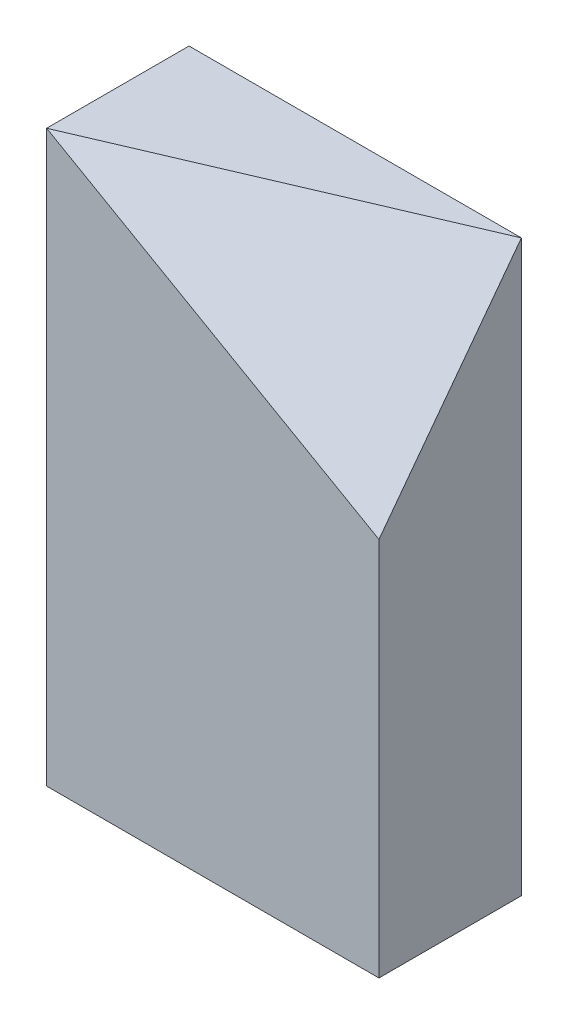
ISO-10303-21;
HEADER;
FILE_DESCRIPTION(('STEP AP214'),'2;1');
FILE_NAME('part.step','',(''),(''),'','','');
FILE_SCHEMA(('AUTOMOTIVE_DESIGN { 1 0 10303 214 1 1 1 1 }'));
ENDSEC;
DATA;
#1=APPLICATION_CONTEXT('core data for automotive mechanical design processes');
#2=APPLICATION_PROTOCOL_DEFINITION('international standard','automotive_design',2000,#1);
#3=PRODUCT_CONTEXT('',#1,'mechanical');
#4=PRODUCT('Part','Part','',(#3));
#5=PRODUCT_RELATED_PRODUCT_CATEGORY('part','',(#4));
#6=PRODUCT_DEFINITION_FORMATION('','',#4);
#7=PRODUCT_DEFINITION_CONTEXT('part definition',#1,'design');
#8=PRODUCT_DEFINITION('design','',#6,#7);
#9=PRODUCT_DEFINITION_SHAPE('','',#8);
#10=(LENGTH_UNIT() NAMED_UNIT(*) SI_UNIT(.MILLI.,.METRE.));
#11=(NAMED_UNIT(*) PLANE_ANGLE_UNIT() SI_UNIT($,.RADIAN.));
#12=(NAMED_UNIT(*) SI_UNIT($,.STERADIAN.) SOLID_ANGLE_UNIT());
#13=UNCERTAINTY_MEASURE_WITH_UNIT(LENGTH_MEASURE(1.E-05),#10,'distance_accuracy_value','');
#14=(GEOMETRIC_REPRESENTATION_CONTEXT(3) GLOBAL_UNCERTAINTY_ASSIGNED_CONTEXT((#13)) GLOBAL_UNIT_ASSIGNED_CONTEXT((#10,
#11,#12)) REPRESENTATION_CONTEXT('',''));
#15=CARTESIAN_POINT('',(0.,0.,0.));
#16=DIRECTION('',(0.,0.,1.));
#17=DIRECTION('',(1.,0.,0.));
#18=AXIS2_PLACEMENT_3D('',#15,#16,#17);
#19=CARTESIAN_POINT('',(88.9,0.,38.1));
#20=DIRECTION('',(-1.,0.,0.));
#21=DIRECTION('',(0.,-1.,0.));
#22=AXIS2_PLACEMENT_3D('',#19,#20,#21);
#23=PLANE('',#22);
#24=DIRECTION('',(0.,0.8,-0.6));
#25=VECTOR('',#24,1.);
#26=CARTESIAN_POINT('',(88.9,36.576,86.868));
#27=LINE('',#26,#25);
#28=CARTESIAN_POINT('',(88.9,101.6,38.1));
#29=VERTEX_POINT('',#28);
#30=CARTESIAN_POINT('',(88.9,152.4,0.));
#31=VERTEX_POINT('',#30);
#32=EDGE_CURVE('E83',#29,#31,#27,.T.);
#33=ORIENTED_EDGE('',*,*,#32,.F.);
#34=DIRECTION('',(0.,1.,0.));
#35=VECTOR('',#34,1.);
#36=CARTESIAN_POINT('',(88.9,0.,38.1));
#37=LINE('',#36,#35);
#38=CARTESIAN_POINT('',(88.9,0.,38.1));
#39=VERTEX_POINT('',#38);
#40=EDGE_CURVE('E89',#39,#29,#37,.T.);
#41=ORIENTED_EDGE('',*,*,#40,.F.);
#42=DIRECTION('',(0.,0.,-1.));
#43=VECTOR('',#42,1.);
#44=CARTESIAN_POINT('',(88.9,0.,38.1));
#45=LINE('',#44,#43);
#46=CARTESIAN_POINT('',(88.9,0.,0.));
#47=VERTEX_POINT('',#46);
#48=EDGE_CURVE('E97',#39,#47,#45,.T.);
#49=ORIENTED_EDGE('',*,*,#48,.T.);
#50=DIRECTION('',(0.,1.,0.));
#51=VECTOR('',#50,1.);
#52=CARTESIAN_POINT('',(88.9,0.,0.));
#53=LINE('',#52,#51);
#54=EDGE_CURVE('E91',#47,#31,#53,.T.);
#55=ORIENTED_EDGE('',*,*,#54,.T.);
#56=EDGE_LOOP('',(#33,#41,#49,#55));
#57=FACE_BOUND('',#56,.T.);
#58=ADVANCED_FACE('F36',(#57),#23,.F.);
#59=CARTESIAN_POINT('',(88.9,152.4,38.1));
#60=DIRECTION('',(0.,-1.,0.));
#61=DIRECTION('',(0.,0.,-1.));
#62=AXIS2_PLACEMENT_3D('',#59,#60,#61);
#63=PLANE('',#62);
#64=DIRECTION('',(-0.919145030018058,0.,0.393919298579168));
#65=VECTOR('',#64,1.);
#66=CARTESIAN_POINT('',(75.1051724137931,152.4,5.91206896551723));
#67=LINE('',#66,#65);
#68=CARTESIAN_POINT('',(0.,152.4,38.1));
#69=VERTEX_POINT('',#68);
#70=EDGE_CURVE('E53',#31,#69,#67,.T.);
#71=ORIENTED_EDGE('',*,*,#70,.F.);
#72=DIRECTION('',(-1.,0.,0.));
#73=VECTOR('',#72,1.);
#74=CARTESIAN_POINT('',(88.9,152.4,0.));
#75=LINE('',#74,#73);
#76=CARTESIAN_POINT('',(0.,152.4,0.));
#77=VERTEX_POINT('',#76);
#78=EDGE_CURVE('E73',#31,#77,#75,.T.);
#79=ORIENTED_EDGE('',*,*,#78,.T.);
#80=DIRECTION('',(0.,0.,-1.));
#81=VECTOR('',#80,1.);
#82=CARTESIAN_POINT('',(0.,152.4,38.1));
#83=LINE('',#82,#81);
#84=EDGE_CURVE('E95',#69,#77,#83,.T.);
#85=ORIENTED_EDGE('',*,*,#84,.F.);
#86=EDGE_LOOP('',(#71,#79,#85));
#87=FACE_BOUND('',#86,.T.);
#88=ADVANCED_FACE('F125',(#87),#63,.F.);
#89=CARTESIAN_POINT('',(0.,0.,38.1));
#90=DIRECTION('',(0.,0.,1.));
#91=DIRECTION('',(1.,0.,0.));
#92=AXIS2_PLACEMENT_3D('',#89,#90,#91);
#93=PLANE('',#92);
#94=ORIENTED_EDGE('',*,*,#40,.T.);
#95=DIRECTION('',(-0.868243142124459,0.496138938356834,0.));
#96=VECTOR('',#95,1.);
#97=CARTESIAN_POINT('',(65.6492307692308,114.886153846154,38.1));
#98=LINE('',#97,#96);
#99=EDGE_CURVE('E12',#29,#69,#98,.T.);
#100=ORIENTED_EDGE('',*,*,#99,.T.);
#101=DIRECTION('',(0.,-1.,0.));
#102=VECTOR('',#101,1.);
#103=CARTESIAN_POINT('',(0.,152.4,38.1));
#104=LINE('',#103,#102);
#105=CARTESIAN_POINT('',(0.,0.,38.1));
#106=VERTEX_POINT('',#105);
#107=EDGE_CURVE('E99',#69,#106,#104,.T.);
#108=ORIENTED_EDGE('',*,*,#107,.T.);
#109=DIRECTION('',(1.,0.,0.));
#110=VECTOR('',#109,1.);
#111=CARTESIAN_POINT('',(0.,0.,38.1));
#112=LINE('',#111,#110);
#113=EDGE_CURVE('E76',#106,#39,#112,.T.);
#114=ORIENTED_EDGE('',*,*,#113,.T.);
#115=EDGE_LOOP('',(#94,#100,#108,#114));
#116=FACE_BOUND('',#115,.T.);
#117=ADVANCED_FACE('F94',(#116),#93,.T.);
#118=CARTESIAN_POINT('',(0.,152.4,38.1));
#119=DIRECTION('',(1.,0.,0.));
#120=DIRECTION('',(0.,0.,-1.));
#121=AXIS2_PLACEMENT_3D('',#118,#119,#120);
#122=PLANE('',#121);
#123=DIRECTION('',(0.,-1.,0.));
#124=VECTOR('',#123,1.);
#125=CARTESIAN_POINT('',(0.,152.4,0.));
#126=LINE('',#125,#124);
#127=CARTESIAN_POINT('',(0.,0.,0.));
#128=VERTEX_POINT('',#127);
#129=EDGE_CURVE('E92',#77,#128,#126,.T.);
#130=ORIENTED_EDGE('',*,*,#129,.T.);
#131=DIRECTION('',(0.,0.,-1.));
#132=VECTOR('',#131,1.);
#133=CARTESIAN_POINT('',(0.,0.,38.1));
#134=LINE('',#133,#132);
#135=EDGE_CURVE('E45',#106,#128,#134,.T.);
#136=ORIENTED_EDGE('',*,*,#135,.F.);
#137=ORIENTED_EDGE('',*,*,#107,.F.);
#138=ORIENTED_EDGE('',*,*,#84,.T.);
#139=EDGE_LOOP('',(#130,#136,#137,#138));
#140=FACE_BOUND('',#139,.T.);
#141=ADVANCED_FACE('F38',(#140),#122,.F.);
#142=CARTESIAN_POINT('',(0.,0.,38.1));
#143=DIRECTION('',(0.,1.,0.));
#144=DIRECTION('',(0.,0.,1.));
#145=AXIS2_PLACEMENT_3D('',#142,#143,#144);
#146=PLANE('',#145);
#147=DIRECTION('',(1.,0.,0.));
#148=VECTOR('',#147,1.);
#149=CARTESIAN_POINT('',(0.,0.,0.));
#150=LINE('',#149,#148);
#151=EDGE_CURVE('E67',#128,#47,#150,.T.);
#152=ORIENTED_EDGE('',*,*,#151,.T.);
#153=ORIENTED_EDGE('',*,*,#48,.F.);
#154=ORIENTED_EDGE('',*,*,#113,.F.);
#155=ORIENTED_EDGE('',*,*,#135,.T.);
#156=EDGE_LOOP('',(#152,#153,#154,#155));
#157=FACE_BOUND('',#156,.T.);
#158=ADVANCED_FACE('F109',(#157),#146,.F.);
#159=CARTESIAN_POINT('',(0.,0.,0.));
#160=DIRECTION('',(0.,0.,1.));
#161=DIRECTION('',(1.,0.,0.));
#162=AXIS2_PLACEMENT_3D('',#159,#160,#161);
#163=PLANE('',#162);
#164=ORIENTED_EDGE('',*,*,#129,.F.);
#165=ORIENTED_EDGE('',*,*,#78,.F.);
#166=ORIENTED_EDGE('',*,*,#54,.F.);
#167=ORIENTED_EDGE('',*,*,#151,.F.);
#168=EDGE_LOOP('',(#164,#165,#166,#167));
#169=FACE_BOUND('',#168,.T.);
#170=ADVANCED_FACE('F114',(#169),#163,.F.);
#171=CARTESIAN_POINT('',(37.4042366691015,65.4574141709277,87.2765522279036));
#172=DIRECTION('',(0.324324324324324,0.567567567567568,0.756756756756757));
#173=DIRECTION('',(0.,-0.8,0.6));
#174=AXIS2_PLACEMENT_3D('',#171,#172,#173);
#175=PLANE('',#174);
#176=ORIENTED_EDGE('',*,*,#99,.F.);
#177=ORIENTED_EDGE('',*,*,#32,.T.);
#178=ORIENTED_EDGE('',*,*,#70,.T.);
#179=EDGE_LOOP('',(#176,#177,#178));
#180=FACE_BOUND('',#179,.T.);
#181=ADVANCED_FACE('F82',(#180),#175,.T.);
#182=CLOSED_SHELL('',(#58,#88,#117,#141,#158,#170,#181));
#183=MANIFOLD_SOLID_BREP('B2',#182);
#184=ADVANCED_BREP_SHAPE_REPRESENTATION('',(#18,#183),#14);
#185=SHAPE_DEFINITION_REPRESENTATION(#9,#184);
ENDSEC;
END-ISO-10303-21;
